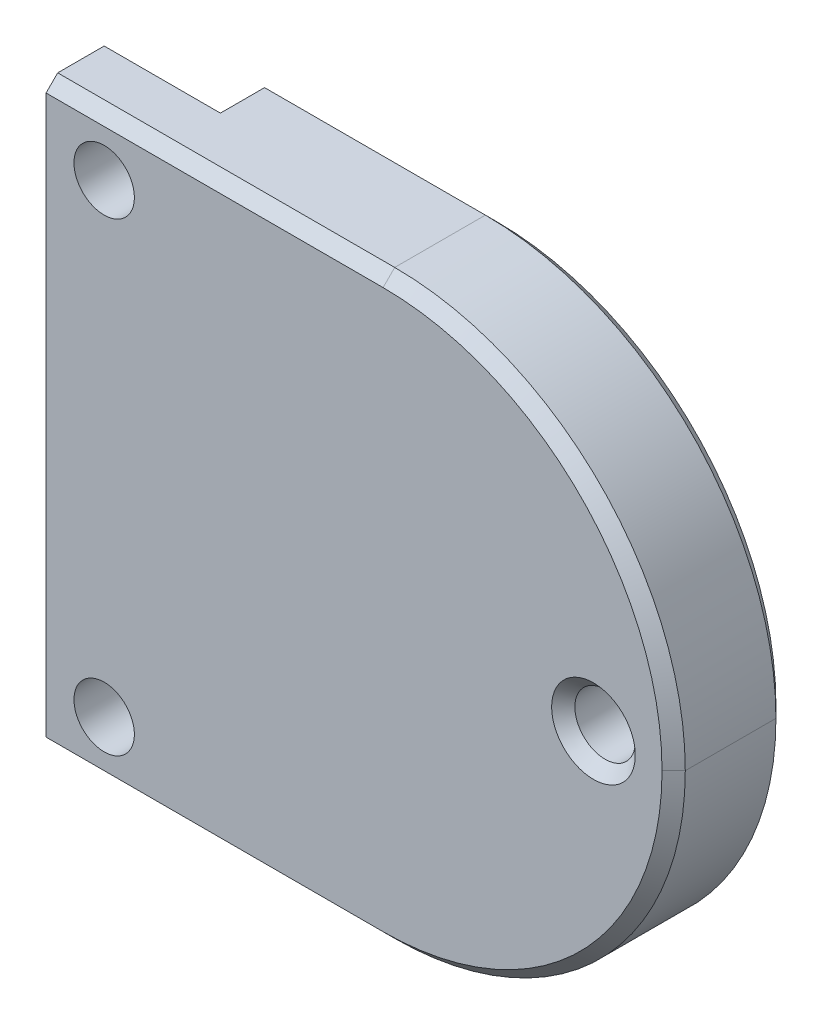
ISO-10303-21;
HEADER;
FILE_DESCRIPTION(('STEP AP214'),'2;1');
FILE_NAME('part.step','',(''),(''),'','','');
FILE_SCHEMA(('AUTOMOTIVE_DESIGN { 1 0 10303 214 1 1 1 1 }'));
ENDSEC;
DATA;
#1=APPLICATION_CONTEXT('core data for automotive mechanical design processes');
#2=APPLICATION_PROTOCOL_DEFINITION('international standard','automotive_design',2000,#1);
#3=PRODUCT_CONTEXT('',#1,'mechanical');
#4=PRODUCT('Part','Part','',(#3));
#5=PRODUCT_RELATED_PRODUCT_CATEGORY('part','',(#4));
#6=PRODUCT_DEFINITION_FORMATION('','',#4);
#7=PRODUCT_DEFINITION_CONTEXT('part definition',#1,'design');
#8=PRODUCT_DEFINITION('design','',#6,#7);
#9=PRODUCT_DEFINITION_SHAPE('','',#8);
#10=(LENGTH_UNIT() NAMED_UNIT(*) SI_UNIT(.MILLI.,.METRE.));
#11=(NAMED_UNIT(*) PLANE_ANGLE_UNIT() SI_UNIT($,.RADIAN.));
#12=(NAMED_UNIT(*) SI_UNIT($,.STERADIAN.) SOLID_ANGLE_UNIT());
#13=UNCERTAINTY_MEASURE_WITH_UNIT(LENGTH_MEASURE(1.E-05),#10,'distance_accuracy_value','');
#14=(GEOMETRIC_REPRESENTATION_CONTEXT(3) GLOBAL_UNCERTAINTY_ASSIGNED_CONTEXT((#13)) GLOBAL_UNIT_ASSIGNED_CONTEXT((#10,
#11,#12)) REPRESENTATION_CONTEXT('',''));
#15=CARTESIAN_POINT('',(0.,0.,0.));
#16=DIRECTION('',(0.,0.,1.));
#17=DIRECTION('',(1.,0.,0.));
#18=AXIS2_PLACEMENT_3D('',#15,#16,#17);
#19=CARTESIAN_POINT('',(0.,0.,5.));
#20=DIRECTION('',(0.,0.,-1.));
#21=DIRECTION('',(-1.,0.,0.));
#22=AXIS2_PLACEMENT_3D('',#19,#20,#21);
#23=PLANE('',#22);
#24=DIRECTION('',(0.,-1.,0.));
#25=VECTOR('',#24,1.);
#26=CARTESIAN_POINT('',(0.,0.,5.));
#27=LINE('',#26,#25);
#28=CARTESIAN_POINT('',(0.,49.,5.));
#29=VERTEX_POINT('',#28);
#30=CARTESIAN_POINT('',(0.,0.999999999999997,5.));
#31=VERTEX_POINT('',#30);
#32=EDGE_CURVE('E142',#29,#31,#27,.T.);
#33=ORIENTED_EDGE('',*,*,#32,.T.);
#34=DIRECTION('',(1.,0.,0.));
#35=VECTOR('',#34,1.);
#36=CARTESIAN_POINT('',(0.,0.999999999999997,5.));
#37=LINE('',#36,#35);
#38=CARTESIAN_POINT('',(29.,0.999999999999993,5.));
#39=VERTEX_POINT('',#38);
#40=EDGE_CURVE('E204',#31,#39,#37,.T.);
#41=ORIENTED_EDGE('',*,*,#40,.T.);
#42=CARTESIAN_POINT('',(29.,25.,5.));
#43=DIRECTION('',(0.,0.,-1.));
#44=DIRECTION('',(-1.,0.,0.));
#45=AXIS2_PLACEMENT_3D('',#42,#43,#44);
#46=CIRCLE('',#45,24.);
#47=CARTESIAN_POINT('',(53.,25.,5.));
#48=VERTEX_POINT('',#47);
#49=EDGE_CURVE('E202',#39,#48,#46,.F.);
#50=ORIENTED_EDGE('',*,*,#49,.T.);
#51=CARTESIAN_POINT('',(29.,25.,5.));
#52=DIRECTION('',(0.,0.,-1.));
#53=DIRECTION('',(-1.,0.,0.));
#54=AXIS2_PLACEMENT_3D('',#51,#52,#53);
#55=CIRCLE('',#54,24.);
#56=CARTESIAN_POINT('',(29.,49.,5.));
#57=VERTEX_POINT('',#56);
#58=EDGE_CURVE('E198',#48,#57,#55,.F.);
#59=ORIENTED_EDGE('',*,*,#58,.T.);
#60=DIRECTION('',(-1.,0.,0.));
#61=VECTOR('',#60,1.);
#62=CARTESIAN_POINT('',(0.,49.,5.));
#63=LINE('',#62,#61);
#64=EDGE_CURVE('E200',#57,#29,#63,.T.);
#65=ORIENTED_EDGE('',*,*,#64,.T.);
#66=EDGE_LOOP('',(#33,#41,#50,#59,#65));
#67=FACE_BOUND('',#66,.T.);
#68=CARTESIAN_POINT('',(47.1,25.,5.));
#69=DIRECTION('',(0.,0.,-1.));
#70=DIRECTION('',(-1.,0.,0.));
#71=AXIS2_PLACEMENT_3D('',#68,#69,#70);
#72=CIRCLE('',#71,3.59999999999998);
#73=CARTESIAN_POINT('',(43.5,25.,5.));
#74=VERTEX_POINT('',#73);
#75=EDGE_CURVE('E190',#74,#74,#72,.T.);
#76=ORIENTED_EDGE('',*,*,#75,.T.);
#77=EDGE_LOOP('',(#76));
#78=FACE_BOUND('',#77,.T.);
#79=CARTESIAN_POINT('',(5.,45.,5.));
#80=DIRECTION('',(0.,0.,1.));
#81=DIRECTION('',(1.,0.,0.));
#82=AXIS2_PLACEMENT_3D('',#79,#80,#81);
#83=CIRCLE('',#82,2.6);
#84=CARTESIAN_POINT('',(7.6,45.,5.));
#85=VERTEX_POINT('',#84);
#86=EDGE_CURVE('E173',#85,#85,#83,.T.);
#87=ORIENTED_EDGE('',*,*,#86,.F.);
#88=EDGE_LOOP('',(#87));
#89=FACE_BOUND('',#88,.T.);
#90=CARTESIAN_POINT('',(5.00000000000042,5.,5.));
#91=DIRECTION('',(0.,0.,1.));
#92=DIRECTION('',(1.,0.,0.));
#93=AXIS2_PLACEMENT_3D('',#90,#91,#92);
#94=CIRCLE('',#93,2.6);
#95=CARTESIAN_POINT('',(7.60000000000041,5.,5.));
#96=VERTEX_POINT('',#95);
#97=EDGE_CURVE('E167',#96,#96,#94,.T.);
#98=ORIENTED_EDGE('',*,*,#97,.F.);
#99=EDGE_LOOP('',(#98));
#100=FACE_BOUND('',#99,.T.);
#101=ADVANCED_FACE('F38',(#67,#78,#89,#100),#23,.F.);
#102=CARTESIAN_POINT('',(0.,0.,0.));
#103=DIRECTION('',(0.,0.,-1.));
#104=DIRECTION('',(-1.,0.,0.));
#105=AXIS2_PLACEMENT_3D('',#102,#103,#104);
#106=PLANE('',#105);
#107=DIRECTION('',(0.,1.,0.));
#108=VECTOR('',#107,1.);
#109=CARTESIAN_POINT('',(10.,50.,0.));
#110=LINE('',#109,#108);
#111=CARTESIAN_POINT('',(10.,0.,0.));
#112=VERTEX_POINT('',#111);
#113=CARTESIAN_POINT('',(10.,50.,0.));
#114=VERTEX_POINT('',#113);
#115=EDGE_CURVE('E136',#112,#114,#110,.T.);
#116=ORIENTED_EDGE('',*,*,#115,.F.);
#117=DIRECTION('',(1.,0.,0.));
#118=VECTOR('',#117,1.);
#119=CARTESIAN_POINT('',(0.,0.,0.));
#120=LINE('',#119,#118);
#121=CARTESIAN_POINT('',(0.,0.,0.));
#122=VERTEX_POINT('',#121);
#123=EDGE_CURVE('E143',#122,#112,#120,.T.);
#124=ORIENTED_EDGE('',*,*,#123,.F.);
#125=DIRECTION('',(0.,-1.,0.));
#126=VECTOR('',#125,1.);
#127=CARTESIAN_POINT('',(0.,0.,0.));
#128=LINE('',#127,#126);
#129=CARTESIAN_POINT('',(0.,50.,0.));
#130=VERTEX_POINT('',#129);
#131=EDGE_CURVE('E139',#130,#122,#128,.T.);
#132=ORIENTED_EDGE('',*,*,#131,.F.);
#133=DIRECTION('',(-1.,0.,0.));
#134=VECTOR('',#133,1.);
#135=CARTESIAN_POINT('',(0.,50.,0.));
#136=LINE('',#135,#134);
#137=EDGE_CURVE('E130',#114,#130,#136,.T.);
#138=ORIENTED_EDGE('',*,*,#137,.F.);
#139=EDGE_LOOP('',(#116,#124,#132,#138));
#140=FACE_BOUND('',#139,.T.);
#141=CARTESIAN_POINT('',(5.,45.,0.));
#142=DIRECTION('',(0.,0.,1.));
#143=DIRECTION('',(1.,0.,0.));
#144=AXIS2_PLACEMENT_3D('',#141,#142,#143);
#145=CIRCLE('',#144,2.6);
#146=CARTESIAN_POINT('',(7.6,45.,0.));
#147=VERTEX_POINT('',#146);
#148=EDGE_CURVE('E170',#147,#147,#145,.T.);
#149=ORIENTED_EDGE('',*,*,#148,.T.);
#150=EDGE_LOOP('',(#149));
#151=FACE_BOUND('',#150,.T.);
#152=CARTESIAN_POINT('',(5.00000000000042,5.,0.));
#153=DIRECTION('',(0.,0.,1.));
#154=DIRECTION('',(1.,0.,0.));
#155=AXIS2_PLACEMENT_3D('',#152,#153,#154);
#156=CIRCLE('',#155,2.6);
#157=CARTESIAN_POINT('',(7.60000000000041,5.,0.));
#158=VERTEX_POINT('',#157);
#159=EDGE_CURVE('E166',#158,#158,#156,.T.);
#160=ORIENTED_EDGE('',*,*,#159,.T.);
#161=EDGE_LOOP('',(#160));
#162=FACE_BOUND('',#161,.T.);
#163=ADVANCED_FACE('F132',(#140,#151,#162),#106,.T.);
#164=CARTESIAN_POINT('',(0.,0.,5.));
#165=DIRECTION('',(1.,0.,0.));
#166=DIRECTION('',(0.,0.,-1.));
#167=AXIS2_PLACEMENT_3D('',#164,#165,#166);
#168=PLANE('',#167);
#169=DIRECTION('',(0.,0.,-1.));
#170=VECTOR('',#169,1.);
#171=CARTESIAN_POINT('',(0.,0.,5.));
#172=LINE('',#171,#170);
#173=CARTESIAN_POINT('',(0.,0.,4.00000000000002));
#174=VERTEX_POINT('',#173);
#175=EDGE_CURVE('E184',#174,#122,#172,.T.);
#176=ORIENTED_EDGE('',*,*,#175,.F.);
#177=DIRECTION('',(0.,-0.707106781186552,-0.707106781186543));
#178=VECTOR('',#177,1.);
#179=CARTESIAN_POINT('',(0.,0.999999999999997,5.));
#180=LINE('',#179,#178);
#181=EDGE_CURVE('E211',#174,#31,#180,.F.);
#182=ORIENTED_EDGE('',*,*,#181,.T.);
#183=ORIENTED_EDGE('',*,*,#32,.F.);
#184=DIRECTION('',(0.,-0.707106781186551,0.707106781186544));
#185=VECTOR('',#184,1.);
#186=CARTESIAN_POINT('',(0.,49.,5.));
#187=LINE('',#186,#185);
#188=CARTESIAN_POINT('',(0.,50.,4.00000000000002));
#189=VERTEX_POINT('',#188);
#190=EDGE_CURVE('E209',#29,#189,#187,.F.);
#191=ORIENTED_EDGE('',*,*,#190,.T.);
#192=DIRECTION('',(0.,0.,-1.));
#193=VECTOR('',#192,1.);
#194=CARTESIAN_POINT('',(0.,50.,5.));
#195=LINE('',#194,#193);
#196=EDGE_CURVE('E180',#189,#130,#195,.T.);
#197=ORIENTED_EDGE('',*,*,#196,.T.);
#198=ORIENTED_EDGE('',*,*,#131,.T.);
#199=EDGE_LOOP('',(#176,#182,#183,#191,#197,#198));
#200=FACE_BOUND('',#199,.T.);
#201=ADVANCED_FACE('F271',(#200),#168,.F.);
#202=CARTESIAN_POINT('',(0.,0.,5.));
#203=DIRECTION('',(0.,1.,0.));
#204=DIRECTION('',(0.,0.,1.));
#205=AXIS2_PLACEMENT_3D('',#202,#203,#204);
#206=PLANE('',#205);
#207=DIRECTION('',(0.,0.,1.));
#208=VECTOR('',#207,1.);
#209=CARTESIAN_POINT('',(10.,0.,0.));
#210=LINE('',#209,#208);
#211=CARTESIAN_POINT('',(10.,0.,-3.8));
#212=VERTEX_POINT('',#211);
#213=EDGE_CURVE('E157',#212,#112,#210,.T.);
#214=ORIENTED_EDGE('',*,*,#213,.F.);
#215=DIRECTION('',(1.,0.,0.));
#216=VECTOR('',#215,1.);
#217=CARTESIAN_POINT('',(29.,0.,-3.8));
#218=LINE('',#217,#216);
#219=CARTESIAN_POINT('',(29.,0.,-3.80000000000001));
#220=VERTEX_POINT('',#219);
#221=EDGE_CURVE('E241',#212,#220,#218,.T.);
#222=ORIENTED_EDGE('',*,*,#221,.T.);
#223=DIRECTION('',(0.,0.,-1.));
#224=VECTOR('',#223,1.);
#225=CARTESIAN_POINT('',(29.,0.,5.));
#226=LINE('',#225,#224);
#227=CARTESIAN_POINT('',(29.,0.,4.00000000000002));
#228=VERTEX_POINT('',#227);
#229=EDGE_CURVE('E186',#220,#228,#226,.F.);
#230=ORIENTED_EDGE('',*,*,#229,.T.);
#231=DIRECTION('',(-1.,0.,0.));
#232=VECTOR('',#231,1.);
#233=CARTESIAN_POINT('',(0.,0.,4.00000000000002));
#234=LINE('',#233,#232);
#235=EDGE_CURVE('E207',#228,#174,#234,.T.);
#236=ORIENTED_EDGE('',*,*,#235,.T.);
#237=ORIENTED_EDGE('',*,*,#175,.T.);
#238=ORIENTED_EDGE('',*,*,#123,.T.);
#239=EDGE_LOOP('',(#214,#222,#230,#236,#237,#238));
#240=FACE_BOUND('',#239,.T.);
#241=ADVANCED_FACE('F268',(#240),#206,.F.);
#242=CARTESIAN_POINT('',(0.,50.,5.));
#243=DIRECTION('',(0.,-1.,0.));
#244=DIRECTION('',(0.,0.,-1.));
#245=AXIS2_PLACEMENT_3D('',#242,#243,#244);
#246=PLANE('',#245);
#247=DIRECTION('',(0.,0.,-1.));
#248=VECTOR('',#247,1.);
#249=CARTESIAN_POINT('',(29.,50.,5.));
#250=LINE('',#249,#248);
#251=CARTESIAN_POINT('',(29.,50.,4.00000000000002));
#252=VERTEX_POINT('',#251);
#253=CARTESIAN_POINT('',(29.,50.,-3.80000000000001));
#254=VERTEX_POINT('',#253);
#255=EDGE_CURVE('E188',#252,#254,#250,.T.);
#256=ORIENTED_EDGE('',*,*,#255,.T.);
#257=DIRECTION('',(-1.,0.,0.));
#258=VECTOR('',#257,1.);
#259=CARTESIAN_POINT('',(10.,50.,-3.80000000000001));
#260=LINE('',#259,#258);
#261=CARTESIAN_POINT('',(10.,50.,-3.80000000000001));
#262=VERTEX_POINT('',#261);
#263=EDGE_CURVE('E149',#254,#262,#260,.T.);
#264=ORIENTED_EDGE('',*,*,#263,.T.);
#265=DIRECTION('',(0.,0.,-1.));
#266=VECTOR('',#265,1.);
#267=CARTESIAN_POINT('',(10.,50.,0.));
#268=LINE('',#267,#266);
#269=EDGE_CURVE('E146',#114,#262,#268,.T.);
#270=ORIENTED_EDGE('',*,*,#269,.F.);
#271=ORIENTED_EDGE('',*,*,#137,.T.);
#272=ORIENTED_EDGE('',*,*,#196,.F.);
#273=DIRECTION('',(1.,0.,0.));
#274=VECTOR('',#273,1.);
#275=CARTESIAN_POINT('',(0.,50.,4.00000000000002));
#276=LINE('',#275,#274);
#277=EDGE_CURVE('E216',#189,#252,#276,.T.);
#278=ORIENTED_EDGE('',*,*,#277,.T.);
#279=EDGE_LOOP('',(#256,#264,#270,#271,#272,#278));
#280=FACE_BOUND('',#279,.T.);
#281=ADVANCED_FACE('F147',(#280),#246,.F.);
#282=CARTESIAN_POINT('',(5.,45.,5.));
#283=DIRECTION('',(0.,0.,-1.));
#284=DIRECTION('',(-1.,0.,0.));
#285=AXIS2_PLACEMENT_3D('',#282,#283,#284);
#286=CYLINDRICAL_SURFACE('',#285,2.6);
#287=ORIENTED_EDGE('',*,*,#86,.T.);
#288=EDGE_LOOP('',(#287));
#289=FACE_BOUND('',#288,.T.);
#290=ORIENTED_EDGE('',*,*,#148,.F.);
#291=EDGE_LOOP('',(#290));
#292=FACE_BOUND('',#291,.T.);
#293=ADVANCED_FACE('F309',(#289,#292),#286,.F.);
#294=CARTESIAN_POINT('',(5.00000000000042,5.,5.));
#295=DIRECTION('',(0.,0.,-1.));
#296=DIRECTION('',(-1.,0.,0.));
#297=AXIS2_PLACEMENT_3D('',#294,#295,#296);
#298=CYLINDRICAL_SURFACE('',#297,2.6);
#299=ORIENTED_EDGE('',*,*,#97,.T.);
#300=EDGE_LOOP('',(#299));
#301=FACE_BOUND('',#300,.T.);
#302=ORIENTED_EDGE('',*,*,#159,.F.);
#303=EDGE_LOOP('',(#302));
#304=FACE_BOUND('',#303,.T.);
#305=ADVANCED_FACE('F306',(#301,#304),#298,.F.);
#306=CARTESIAN_POINT('',(54.,50.,-4.8));
#307=DIRECTION('',(0.,0.,-1.));
#308=DIRECTION('',(0.,1.,0.));
#309=AXIS2_PLACEMENT_3D('',#306,#307,#308);
#310=PLANE('',#309);
#311=CARTESIAN_POINT('',(47.1,25.,-4.8));
#312=DIRECTION('',(0.,0.,-1.));
#313=DIRECTION('',(0.,1.,0.));
#314=AXIS2_PLACEMENT_3D('',#311,#312,#313);
#315=CIRCLE('',#314,2.6);
#316=CARTESIAN_POINT('',(47.1,27.6,-4.8));
#317=VERTEX_POINT('',#316);
#318=EDGE_CURVE('E158',#317,#317,#315,.T.);
#319=ORIENTED_EDGE('',*,*,#318,.F.);
#320=EDGE_LOOP('',(#319));
#321=FACE_BOUND('',#320,.T.);
#322=CARTESIAN_POINT('',(29.,25.,-4.8));
#323=DIRECTION('',(0.,0.,-1.));
#324=DIRECTION('',(0.,1.,0.));
#325=AXIS2_PLACEMENT_3D('',#322,#323,#324);
#326=CIRCLE('',#325,24.);
#327=CARTESIAN_POINT('',(53.,25.,-4.8));
#328=VERTEX_POINT('',#327);
#329=CARTESIAN_POINT('',(29.,0.999999999999991,-4.79999999999999));
#330=VERTEX_POINT('',#329);
#331=EDGE_CURVE('E230',#328,#330,#326,.T.);
#332=ORIENTED_EDGE('',*,*,#331,.T.);
#333=DIRECTION('',(-1.,0.,0.));
#334=VECTOR('',#333,1.);
#335=CARTESIAN_POINT('',(10.,0.999999999999994,-4.79999999999999));
#336=LINE('',#335,#334);
#337=CARTESIAN_POINT('',(10.,0.999999999999994,-4.79999999999999));
#338=VERTEX_POINT('',#337);
#339=EDGE_CURVE('E234',#330,#338,#336,.T.);
#340=ORIENTED_EDGE('',*,*,#339,.T.);
#341=DIRECTION('',(0.,-1.,0.));
#342=VECTOR('',#341,1.);
#343=CARTESIAN_POINT('',(10.,50.,-4.8));
#344=LINE('',#343,#342);
#345=CARTESIAN_POINT('',(10.,49.,-4.8));
#346=VERTEX_POINT('',#345);
#347=EDGE_CURVE('E152',#346,#338,#344,.T.);
#348=ORIENTED_EDGE('',*,*,#347,.F.);
#349=DIRECTION('',(1.,0.,0.));
#350=VECTOR('',#349,1.);
#351=CARTESIAN_POINT('',(29.,49.,-4.8));
#352=LINE('',#351,#350);
#353=CARTESIAN_POINT('',(29.,49.,-4.8));
#354=VERTEX_POINT('',#353);
#355=EDGE_CURVE('E232',#346,#354,#352,.T.);
#356=ORIENTED_EDGE('',*,*,#355,.T.);
#357=CARTESIAN_POINT('',(29.,25.,-4.8));
#358=DIRECTION('',(0.,0.,-1.));
#359=DIRECTION('',(0.,1.,0.));
#360=AXIS2_PLACEMENT_3D('',#357,#358,#359);
#361=CIRCLE('',#360,24.);
#362=EDGE_CURVE('E221',#354,#328,#361,.T.);
#363=ORIENTED_EDGE('',*,*,#362,.T.);
#364=EDGE_LOOP('',(#332,#340,#348,#356,#363));
#365=FACE_BOUND('',#364,.T.);
#366=ADVANCED_FACE('F261',(#321,#365),#310,.T.);
#367=CARTESIAN_POINT('',(10.,0.,0.));
#368=DIRECTION('',(1.,0.,0.));
#369=DIRECTION('',(0.,0.,-1.));
#370=AXIS2_PLACEMENT_3D('',#367,#368,#369);
#371=PLANE('',#370);
#372=ORIENTED_EDGE('',*,*,#347,.T.);
#373=DIRECTION('',(0.,-0.707106781186548,0.707106781186547));
#374=VECTOR('',#373,1.);
#375=CARTESIAN_POINT('',(10.,0.999999999999994,-4.79999999999999));
#376=LINE('',#375,#374);
#377=EDGE_CURVE('E239',#338,#212,#376,.T.);
#378=ORIENTED_EDGE('',*,*,#377,.T.);
#379=ORIENTED_EDGE('',*,*,#213,.T.);
#380=ORIENTED_EDGE('',*,*,#115,.T.);
#381=ORIENTED_EDGE('',*,*,#269,.T.);
#382=DIRECTION('',(0.,-0.707106781186549,-0.707106781186546));
#383=VECTOR('',#382,1.);
#384=CARTESIAN_POINT('',(10.,50.,-3.80000000000001));
#385=LINE('',#384,#383);
#386=EDGE_CURVE('E237',#262,#346,#385,.T.);
#387=ORIENTED_EDGE('',*,*,#386,.T.);
#388=EDGE_LOOP('',(#372,#378,#379,#380,#381,#387));
#389=FACE_BOUND('',#388,.T.);
#390=ADVANCED_FACE('F155',(#389),#371,.F.);
#391=CARTESIAN_POINT('',(47.1,25.,5.2));
#392=DIRECTION('',(0.,0.,-1.));
#393=DIRECTION('',(0.,1.,0.));
#394=AXIS2_PLACEMENT_3D('',#391,#392,#393);
#395=CYLINDRICAL_SURFACE('',#394,2.6);
#396=CARTESIAN_POINT('',(47.1,25.,4.00000000000001));
#397=DIRECTION('',(0.,0.,-1.));
#398=DIRECTION('',(-1.,0.,0.));
#399=AXIS2_PLACEMENT_3D('',#396,#397,#398);
#400=CIRCLE('',#399,2.6);
#401=CARTESIAN_POINT('',(44.5,25.,4.00000000000001));
#402=VERTEX_POINT('',#401);
#403=EDGE_CURVE('E195',#402,#402,#400,.F.);
#404=ORIENTED_EDGE('',*,*,#403,.T.);
#405=EDGE_LOOP('',(#404));
#406=FACE_BOUND('',#405,.T.);
#407=ORIENTED_EDGE('',*,*,#318,.T.);
#408=EDGE_LOOP('',(#407));
#409=FACE_BOUND('',#408,.T.);
#410=ADVANCED_FACE('F330',(#406,#409),#395,.F.);
#411=CARTESIAN_POINT('',(29.,25.,5.));
#412=DIRECTION('',(0.,0.,-1.));
#413=DIRECTION('',(-1.,0.,0.));
#414=AXIS2_PLACEMENT_3D('',#411,#412,#413);
#415=CYLINDRICAL_SURFACE('',#414,25.);
#416=DIRECTION('',(0.,0.,-1.));
#417=VECTOR('',#416,1.);
#418=CARTESIAN_POINT('',(54.,25.,5.));
#419=LINE('',#418,#417);
#420=CARTESIAN_POINT('',(54.,25.,-3.80000000000001));
#421=VERTEX_POINT('',#420);
#422=CARTESIAN_POINT('',(54.,25.,4.00000000000002));
#423=VERTEX_POINT('',#422);
#424=EDGE_CURVE('E161',#421,#423,#419,.F.);
#425=ORIENTED_EDGE('',*,*,#424,.F.);
#426=CARTESIAN_POINT('',(29.,25.,-3.80000000000001));
#427=DIRECTION('',(0.,0.,-1.));
#428=DIRECTION('',(-1.,0.,0.));
#429=AXIS2_PLACEMENT_3D('',#426,#427,#428);
#430=CIRCLE('',#429,25.);
#431=EDGE_CURVE('E11',#421,#254,#430,.F.);
#432=ORIENTED_EDGE('',*,*,#431,.T.);
#433=ORIENTED_EDGE('',*,*,#255,.F.);
#434=CARTESIAN_POINT('',(29.,25.,4.00000000000002));
#435=DIRECTION('',(0.,0.,-1.));
#436=DIRECTION('',(-1.,0.,0.));
#437=AXIS2_PLACEMENT_3D('',#434,#435,#436);
#438=CIRCLE('',#437,25.);
#439=EDGE_CURVE('E218',#252,#423,#438,.T.);
#440=ORIENTED_EDGE('',*,*,#439,.T.);
#441=EDGE_LOOP('',(#425,#432,#433,#440));
#442=FACE_BOUND('',#441,.T.);
#443=ADVANCED_FACE('F286',(#442),#415,.T.);
#444=CARTESIAN_POINT('',(29.,25.,5.));
#445=DIRECTION('',(0.,0.,-1.));
#446=DIRECTION('',(-1.,0.,0.));
#447=AXIS2_PLACEMENT_3D('',#444,#445,#446);
#448=CYLINDRICAL_SURFACE('',#447,25.);
#449=ORIENTED_EDGE('',*,*,#229,.F.);
#450=CARTESIAN_POINT('',(29.,25.,-3.80000000000001));
#451=DIRECTION('',(0.,0.,-1.));
#452=DIRECTION('',(-1.,0.,0.));
#453=AXIS2_PLACEMENT_3D('',#450,#451,#452);
#454=CIRCLE('',#453,25.);
#455=EDGE_CURVE('E48',#220,#421,#454,.F.);
#456=ORIENTED_EDGE('',*,*,#455,.T.);
#457=ORIENTED_EDGE('',*,*,#424,.T.);
#458=CARTESIAN_POINT('',(29.,25.,4.00000000000002));
#459=DIRECTION('',(0.,0.,-1.));
#460=DIRECTION('',(-1.,0.,0.));
#461=AXIS2_PLACEMENT_3D('',#458,#459,#460);
#462=CIRCLE('',#461,25.);
#463=EDGE_CURVE('E213',#423,#228,#462,.T.);
#464=ORIENTED_EDGE('',*,*,#463,.T.);
#465=EDGE_LOOP('',(#449,#456,#457,#464));
#466=FACE_BOUND('',#465,.T.);
#467=ADVANCED_FACE('F287',(#466),#448,.T.);
#468=CARTESIAN_POINT('',(47.1,25.,5.));
#469=DIRECTION('',(0.,0.,1.));
#470=DIRECTION('',(1.,0.,0.));
#471=AXIS2_PLACEMENT_3D('',#468,#469,#470);
#472=CONICAL_SURFACE('',#471,3.59999999999998,0.785398163397443);
#473=ORIENTED_EDGE('',*,*,#403,.F.);
#474=EDGE_LOOP('',(#473));
#475=FACE_BOUND('',#474,.T.);
#476=ORIENTED_EDGE('',*,*,#75,.F.);
#477=EDGE_LOOP('',(#476));
#478=FACE_BOUND('',#477,.T.);
#479=ADVANCED_FACE('F327',(#475,#478),#472,.F.);
#480=CARTESIAN_POINT('',(0.,49.,5.));
#481=DIRECTION('',(0.,-0.707106781186544,-0.707106781186551));
#482=DIRECTION('',(-1.,0.,0.));
#483=AXIS2_PLACEMENT_3D('',#480,#481,#482);
#484=PLANE('',#483);
#485=ORIENTED_EDGE('',*,*,#190,.F.);
#486=ORIENTED_EDGE('',*,*,#64,.F.);
#487=DIRECTION('',(0.,-0.707106781186551,0.707106781186544));
#488=VECTOR('',#487,1.);
#489=CARTESIAN_POINT('',(29.,50.,4.00000000000002));
#490=LINE('',#489,#488);
#491=EDGE_CURVE('E192',#252,#57,#490,.T.);
#492=ORIENTED_EDGE('',*,*,#491,.F.);
#493=ORIENTED_EDGE('',*,*,#277,.F.);
#494=EDGE_LOOP('',(#485,#486,#492,#493));
#495=FACE_BOUND('',#494,.T.);
#496=ADVANCED_FACE('F278',(#495),#484,.F.);
#497=CARTESIAN_POINT('',(29.,25.,5.));
#498=DIRECTION('',(0.,0.,-1.));
#499=DIRECTION('',(-1.,0.,0.));
#500=AXIS2_PLACEMENT_3D('',#497,#498,#499);
#501=CONICAL_SURFACE('',#500,24.,0.785398163397453);
#502=ORIENTED_EDGE('',*,*,#491,.T.);
#503=ORIENTED_EDGE('',*,*,#58,.F.);
#504=DIRECTION('',(-0.707106781186551,0.,0.707106781186544));
#505=VECTOR('',#504,1.);
#506=CARTESIAN_POINT('',(54.,25.,4.00000000000002));
#507=LINE('',#506,#505);
#508=EDGE_CURVE('E224',#423,#48,#507,.T.);
#509=ORIENTED_EDGE('',*,*,#508,.F.);
#510=ORIENTED_EDGE('',*,*,#439,.F.);
#511=EDGE_LOOP('',(#502,#503,#509,#510));
#512=FACE_BOUND('',#511,.T.);
#513=ADVANCED_FACE('F284',(#512),#501,.T.);
#514=CARTESIAN_POINT('',(29.,25.,5.));
#515=DIRECTION('',(0.,0.,-1.));
#516=DIRECTION('',(-1.,0.,0.));
#517=AXIS2_PLACEMENT_3D('',#514,#515,#516);
#518=CONICAL_SURFACE('',#517,24.,0.785398163397453);
#519=ORIENTED_EDGE('',*,*,#508,.T.);
#520=ORIENTED_EDGE('',*,*,#49,.F.);
#521=DIRECTION('',(0.,0.707106781186551,0.707106781186544));
#522=VECTOR('',#521,1.);
#523=CARTESIAN_POINT('',(29.,0.,4.00000000000002));
#524=LINE('',#523,#522);
#525=EDGE_CURVE('E222',#228,#39,#524,.T.);
#526=ORIENTED_EDGE('',*,*,#525,.F.);
#527=ORIENTED_EDGE('',*,*,#463,.F.);
#528=EDGE_LOOP('',(#519,#520,#526,#527));
#529=FACE_BOUND('',#528,.T.);
#530=ADVANCED_FACE('F295',(#529),#518,.T.);
#531=CARTESIAN_POINT('',(0.,0.999999999999997,5.));
#532=DIRECTION('',(0.,0.707106781186543,-0.707106781186552));
#533=DIRECTION('',(1.,0.,0.));
#534=AXIS2_PLACEMENT_3D('',#531,#532,#533);
#535=PLANE('',#534);
#536=ORIENTED_EDGE('',*,*,#181,.F.);
#537=ORIENTED_EDGE('',*,*,#235,.F.);
#538=ORIENTED_EDGE('',*,*,#525,.T.);
#539=ORIENTED_EDGE('',*,*,#40,.F.);
#540=EDGE_LOOP('',(#536,#537,#538,#539));
#541=FACE_BOUND('',#540,.T.);
#542=ADVANCED_FACE('F292',(#541),#535,.F.);
#543=CARTESIAN_POINT('',(0.,50.,-3.80000000000001));
#544=DIRECTION('',(0.,0.707106781186546,-0.707106781186549));
#545=DIRECTION('',(1.,0.,0.));
#546=AXIS2_PLACEMENT_3D('',#543,#544,#545);
#547=PLANE('',#546);
#548=ORIENTED_EDGE('',*,*,#386,.F.);
#549=ORIENTED_EDGE('',*,*,#263,.F.);
#550=DIRECTION('',(0.,0.707106781186549,0.707106781186546));
#551=VECTOR('',#550,1.);
#552=CARTESIAN_POINT('',(29.,49.,-4.8));
#553=LINE('',#552,#551);
#554=EDGE_CURVE('E43',#354,#254,#553,.T.);
#555=ORIENTED_EDGE('',*,*,#554,.F.);
#556=ORIENTED_EDGE('',*,*,#355,.F.);
#557=EDGE_LOOP('',(#548,#549,#555,#556));
#558=FACE_BOUND('',#557,.T.);
#559=ADVANCED_FACE('F41',(#558),#547,.T.);
#560=CARTESIAN_POINT('',(29.,25.,-4.8));
#561=DIRECTION('',(0.,0.,1.));
#562=DIRECTION('',(1.,0.,0.));
#563=AXIS2_PLACEMENT_3D('',#560,#561,#562);
#564=CONICAL_SURFACE('',#563,24.,0.78539816339745);
#565=ORIENTED_EDGE('',*,*,#554,.T.);
#566=ORIENTED_EDGE('',*,*,#431,.F.);
#567=DIRECTION('',(0.707106781186548,0.,0.707106781186547));
#568=VECTOR('',#567,1.);
#569=CARTESIAN_POINT('',(53.,25.,-4.8));
#570=LINE('',#569,#568);
#571=EDGE_CURVE('E247',#328,#421,#570,.T.);
#572=ORIENTED_EDGE('',*,*,#571,.F.);
#573=ORIENTED_EDGE('',*,*,#362,.F.);
#574=EDGE_LOOP('',(#565,#566,#572,#573));
#575=FACE_BOUND('',#574,.T.);
#576=ADVANCED_FACE('F256',(#575),#564,.T.);
#577=CARTESIAN_POINT('',(29.,25.,-4.8));
#578=DIRECTION('',(0.,0.,1.));
#579=DIRECTION('',(1.,0.,0.));
#580=AXIS2_PLACEMENT_3D('',#577,#578,#579);
#581=CONICAL_SURFACE('',#580,24.,0.78539816339745);
#582=ORIENTED_EDGE('',*,*,#571,.T.);
#583=ORIENTED_EDGE('',*,*,#455,.F.);
#584=DIRECTION('',(0.,-0.707106781186549,0.707106781186547));
#585=VECTOR('',#584,1.);
#586=CARTESIAN_POINT('',(29.,0.999999999999991,-4.79999999999999));
#587=LINE('',#586,#585);
#588=EDGE_CURVE('E245',#330,#220,#587,.T.);
#589=ORIENTED_EDGE('',*,*,#588,.F.);
#590=ORIENTED_EDGE('',*,*,#331,.F.);
#591=EDGE_LOOP('',(#582,#583,#589,#590));
#592=FACE_BOUND('',#591,.T.);
#593=ADVANCED_FACE('F363',(#592),#581,.T.);
#594=CARTESIAN_POINT('',(54.,0.999999999999994,-4.79999999999999));
#595=DIRECTION('',(0.,-0.707106781186547,-0.707106781186548));
#596=DIRECTION('',(1.,0.,0.));
#597=AXIS2_PLACEMENT_3D('',#594,#595,#596);
#598=PLANE('',#597);
#599=ORIENTED_EDGE('',*,*,#588,.T.);
#600=ORIENTED_EDGE('',*,*,#221,.F.);
#601=ORIENTED_EDGE('',*,*,#377,.F.);
#602=ORIENTED_EDGE('',*,*,#339,.F.);
#603=EDGE_LOOP('',(#599,#600,#601,#602));
#604=FACE_BOUND('',#603,.T.);
#605=ADVANCED_FACE('F265',(#604),#598,.T.);
#606=CLOSED_SHELL('',(#101,#163,#201,#241,#281,#293,#305,#366,#390,#410,#443,#467,#479,#496,
#513,#530,#542,#559,#576,#593,#605));
#607=MANIFOLD_SOLID_BREP('B2',#606);
#608=ADVANCED_BREP_SHAPE_REPRESENTATION('',(#18,#607),#14);
#609=SHAPE_DEFINITION_REPRESENTATION(#9,#608);
ENDSEC;
END-ISO-10303-21;
